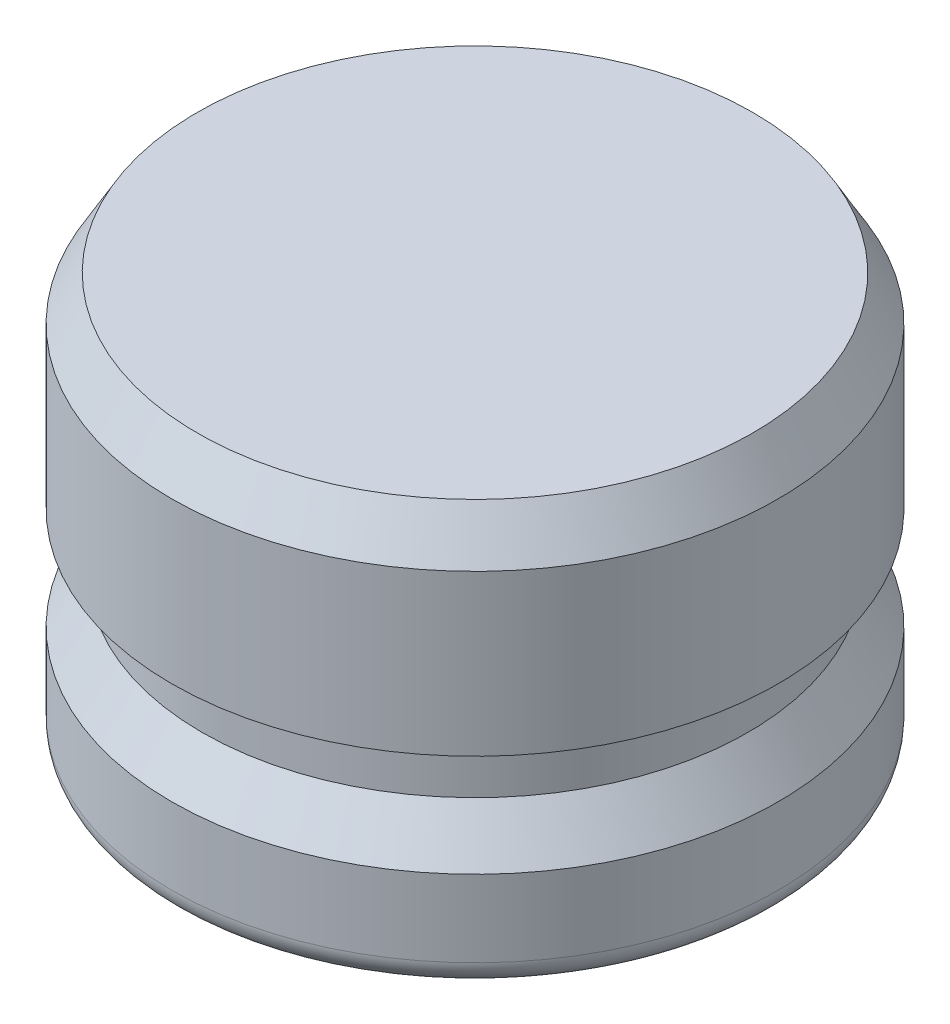
ISO-10303-21;
HEADER;
FILE_DESCRIPTION(('STEP AP214'),'2;1');
FILE_NAME('part.step','',(''),(''),'','','');
FILE_SCHEMA(('AUTOMOTIVE_DESIGN { 1 0 10303 214 1 1 1 1 }'));
ENDSEC;
DATA;
#1=APPLICATION_CONTEXT('core data for automotive mechanical design processes');
#2=APPLICATION_PROTOCOL_DEFINITION('international standard','automotive_design',2000,#1);
#3=PRODUCT_CONTEXT('',#1,'mechanical');
#4=PRODUCT('Part','Part','',(#3));
#5=PRODUCT_RELATED_PRODUCT_CATEGORY('part','',(#4));
#6=PRODUCT_DEFINITION_FORMATION('','',#4);
#7=PRODUCT_DEFINITION_CONTEXT('part definition',#1,'design');
#8=PRODUCT_DEFINITION('design','',#6,#7);
#9=PRODUCT_DEFINITION_SHAPE('','',#8);
#10=(LENGTH_UNIT() NAMED_UNIT(*) SI_UNIT(.MILLI.,.METRE.));
#11=(NAMED_UNIT(*) PLANE_ANGLE_UNIT() SI_UNIT($,.RADIAN.));
#12=(NAMED_UNIT(*) SI_UNIT($,.STERADIAN.) SOLID_ANGLE_UNIT());
#13=UNCERTAINTY_MEASURE_WITH_UNIT(LENGTH_MEASURE(1.E-05),#10,'distance_accuracy_value','');
#14=(GEOMETRIC_REPRESENTATION_CONTEXT(3) GLOBAL_UNCERTAINTY_ASSIGNED_CONTEXT((#13)) GLOBAL_UNIT_ASSIGNED_CONTEXT((#10,
#11,#12)) REPRESENTATION_CONTEXT('',''));
#15=CARTESIAN_POINT('',(0.,0.,0.));
#16=DIRECTION('',(0.,0.,1.));
#17=DIRECTION('',(1.,0.,0.));
#18=AXIS2_PLACEMENT_3D('',#15,#16,#17);
#19=CARTESIAN_POINT('',(0.,0.,0.));
#20=DIRECTION('',(0.,1.,0.));
#21=DIRECTION('',(0.,0.,1.));
#22=AXIS2_PLACEMENT_3D('',#19,#20,#21);
#23=PLANE('',#22);
#24=CARTESIAN_POINT('',(0.,0.,0.));
#25=DIRECTION('',(0.,1.,0.));
#26=DIRECTION('',(0.,0.,1.));
#27=AXIS2_PLACEMENT_3D('',#24,#25,#26);
#28=CIRCLE('',#27,8.62965);
#29=CARTESIAN_POINT('',(0.,0.,8.62965));
#30=VERTEX_POINT('',#29);
#31=EDGE_CURVE('E46',#30,#30,#28,.F.);
#32=ORIENTED_EDGE('',*,*,#31,.T.);
#33=EDGE_LOOP('',(#32));
#34=FACE_BOUND('',#33,.T.);
#35=ADVANCED_FACE('F31',(#34),#23,.F.);
#36=CARTESIAN_POINT('',(0.,0.,0.));
#37=DIRECTION('',(0.,-1.,0.));
#38=DIRECTION('',(0.,0.,-1.));
#39=AXIS2_PLACEMENT_3D('',#36,#37,#38);
#40=CYLINDRICAL_SURFACE('',#39,9.4234);
#41=CARTESIAN_POINT('',(0.,0.793749999999999,0.));
#42=DIRECTION('',(0.,1.,0.));
#43=DIRECTION('',(0.,0.,1.));
#44=AXIS2_PLACEMENT_3D('',#41,#42,#43);
#45=CIRCLE('',#44,9.4234);
#46=CARTESIAN_POINT('',(0.,0.793749999999999,9.4234));
#47=VERTEX_POINT('',#46);
#48=EDGE_CURVE('E42',#47,#47,#45,.T.);
#49=ORIENTED_EDGE('',*,*,#48,.T.);
#50=EDGE_LOOP('',(#49));
#51=FACE_BOUND('',#50,.T.);
#52=CARTESIAN_POINT('',(0.,3.175,0.));
#53=DIRECTION('',(0.,-1.,0.));
#54=DIRECTION('',(0.,0.,-1.));
#55=AXIS2_PLACEMENT_3D('',#52,#53,#54);
#56=CIRCLE('',#55,9.4234);
#57=CARTESIAN_POINT('',(0.,3.175,-9.4234));
#58=VERTEX_POINT('',#57);
#59=EDGE_CURVE('E51',#58,#58,#56,.T.);
#60=ORIENTED_EDGE('',*,*,#59,.T.);
#61=EDGE_LOOP('',(#60));
#62=FACE_BOUND('',#61,.T.);
#63=ADVANCED_FACE('F80',(#51,#62),#40,.T.);
#64=CARTESIAN_POINT('',(0.,4.572,0.));
#65=DIRECTION('',(0.,-1.,0.));
#66=DIRECTION('',(0.,0.,-1.));
#67=AXIS2_PLACEMENT_3D('',#64,#65,#66);
#68=CONICAL_SURFACE('',#67,8.4836,0.592186679549642);
#69=ORIENTED_EDGE('',*,*,#59,.F.);
#70=EDGE_LOOP('',(#69));
#71=FACE_BOUND('',#70,.T.);
#72=CARTESIAN_POINT('',(0.,4.572,0.));
#73=DIRECTION('',(0.,-1.,0.));
#74=DIRECTION('',(0.,0.,-1.));
#75=AXIS2_PLACEMENT_3D('',#72,#73,#74);
#76=CIRCLE('',#75,8.4836);
#77=CARTESIAN_POINT('',(0.,4.572,-8.4836));
#78=VERTEX_POINT('',#77);
#79=EDGE_CURVE('E54',#78,#78,#76,.T.);
#80=ORIENTED_EDGE('',*,*,#79,.T.);
#81=EDGE_LOOP('',(#80));
#82=FACE_BOUND('',#81,.T.);
#83=ADVANCED_FACE('F86',(#71,#82),#68,.T.);
#84=CARTESIAN_POINT('',(0.,0.,0.));
#85=DIRECTION('',(0.,-1.,0.));
#86=DIRECTION('',(0.,0.,-1.));
#87=AXIS2_PLACEMENT_3D('',#84,#85,#86);
#88=CYLINDRICAL_SURFACE('',#87,8.4836);
#89=ORIENTED_EDGE('',*,*,#79,.F.);
#90=EDGE_LOOP('',(#89));
#91=FACE_BOUND('',#90,.T.);
#92=CARTESIAN_POINT('',(0.,6.35,0.));
#93=DIRECTION('',(0.,-1.,0.));
#94=DIRECTION('',(0.,0.,-1.));
#95=AXIS2_PLACEMENT_3D('',#92,#93,#94);
#96=CIRCLE('',#95,8.4836);
#97=CARTESIAN_POINT('',(0.,6.35,-8.4836));
#98=VERTEX_POINT('',#97);
#99=EDGE_CURVE('E57',#98,#98,#96,.T.);
#100=ORIENTED_EDGE('',*,*,#99,.T.);
#101=EDGE_LOOP('',(#100));
#102=FACE_BOUND('',#101,.T.);
#103=ADVANCED_FACE('F76',(#91,#102),#88,.T.);
#104=CARTESIAN_POINT('',(-8.4836,6.35,0.));
#105=DIRECTION('',(0.,1.,0.));
#106=DIRECTION('',(0.,0.,1.));
#107=AXIS2_PLACEMENT_3D('',#104,#105,#106);
#108=PLANE('',#107);
#109=ORIENTED_EDGE('',*,*,#99,.F.);
#110=EDGE_LOOP('',(#109));
#111=FACE_BOUND('',#110,.T.);
#112=CARTESIAN_POINT('',(0.,6.35,0.));
#113=DIRECTION('',(0.,-1.,0.));
#114=DIRECTION('',(0.,0.,-1.));
#115=AXIS2_PLACEMENT_3D('',#112,#113,#114);
#116=CIRCLE('',#115,9.4234);
#117=CARTESIAN_POINT('',(0.,6.35,-9.4234));
#118=VERTEX_POINT('',#117);
#119=EDGE_CURVE('E60',#118,#118,#116,.T.);
#120=ORIENTED_EDGE('',*,*,#119,.T.);
#121=EDGE_LOOP('',(#120));
#122=FACE_BOUND('',#121,.T.);
#123=ADVANCED_FACE('F64',(#111,#122),#108,.F.);
#124=CARTESIAN_POINT('',(0.,0.,0.));
#125=DIRECTION('',(0.,-1.,0.));
#126=DIRECTION('',(0.,0.,-1.));
#127=AXIS2_PLACEMENT_3D('',#124,#125,#126);
#128=CYLINDRICAL_SURFACE('',#127,9.4234);
#129=CARTESIAN_POINT('',(0.,11.3251846714922,0.));
#130=DIRECTION('',(0.,-1.,0.));
#131=DIRECTION('',(0.,0.,-1.));
#132=AXIS2_PLACEMENT_3D('',#129,#130,#131);
#133=CIRCLE('',#132,9.4234);
#134=CARTESIAN_POINT('',(0.,11.3251846714922,-9.4234));
#135=VERTEX_POINT('',#134);
#136=EDGE_CURVE('E38',#135,#135,#133,.T.);
#137=ORIENTED_EDGE('',*,*,#136,.T.);
#138=EDGE_LOOP('',(#137));
#139=FACE_BOUND('',#138,.T.);
#140=ORIENTED_EDGE('',*,*,#119,.F.);
#141=EDGE_LOOP('',(#140));
#142=FACE_BOUND('',#141,.T.);
#143=ADVANCED_FACE('F66',(#139,#142),#128,.T.);
#144=CARTESIAN_POINT('',(-9.4234,12.7,0.));
#145=DIRECTION('',(0.,-1.,0.));
#146=DIRECTION('',(0.,0.,-1.));
#147=AXIS2_PLACEMENT_3D('',#144,#145,#146);
#148=PLANE('',#147);
#149=CARTESIAN_POINT('',(0.,12.7,0.));
#150=DIRECTION('',(0.,-1.,0.));
#151=DIRECTION('',(0.,0.,-1.));
#152=AXIS2_PLACEMENT_3D('',#149,#150,#151);
#153=CIRCLE('',#152,8.62965);
#154=CARTESIAN_POINT('',(0.,12.7,-8.62965));
#155=VERTEX_POINT('',#154);
#156=EDGE_CURVE('E10',#155,#155,#153,.F.);
#157=ORIENTED_EDGE('',*,*,#156,.T.);
#158=EDGE_LOOP('',(#157));
#159=FACE_BOUND('',#158,.T.);
#160=ADVANCED_FACE('F68',(#159),#148,.F.);
#161=CARTESIAN_POINT('',(0.,0.793749999999999,0.));
#162=DIRECTION('',(0.,1.,0.));
#163=DIRECTION('',(0.,0.,1.));
#164=AXIS2_PLACEMENT_3D('',#161,#162,#163);
#165=TOROIDAL_SURFACE('',#164,8.62965,0.79375);
#166=ORIENTED_EDGE('',*,*,#48,.F.);
#167=EDGE_LOOP('',(#166));
#168=FACE_BOUND('',#167,.T.);
#169=ORIENTED_EDGE('',*,*,#31,.F.);
#170=EDGE_LOOP('',(#169));
#171=FACE_BOUND('',#170,.T.);
#172=ADVANCED_FACE('F74',(#168,#171),#165,.T.);
#173=CARTESIAN_POINT('',(0.,11.3251846714922,0.));
#174=DIRECTION('',(0.,-1.,0.));
#175=DIRECTION('',(0.,0.,-1.));
#176=AXIS2_PLACEMENT_3D('',#173,#174,#175);
#177=CONICAL_SURFACE('',#176,9.4234,0.5235987755983);
#178=ORIENTED_EDGE('',*,*,#156,.F.);
#179=EDGE_LOOP('',(#178));
#180=FACE_BOUND('',#179,.T.);
#181=ORIENTED_EDGE('',*,*,#136,.F.);
#182=EDGE_LOOP('',(#181));
#183=FACE_BOUND('',#182,.T.);
#184=ADVANCED_FACE('F33',(#180,#183),#177,.T.);
#185=CLOSED_SHELL('',(#35,#63,#83,#103,#123,#143,#160,#172,#184));
#186=MANIFOLD_SOLID_BREP('B2',#185);
#187=ADVANCED_BREP_SHAPE_REPRESENTATION('',(#18,#186),#14);
#188=SHAPE_DEFINITION_REPRESENTATION(#9,#187);
ENDSEC;
END-ISO-10303-21;
